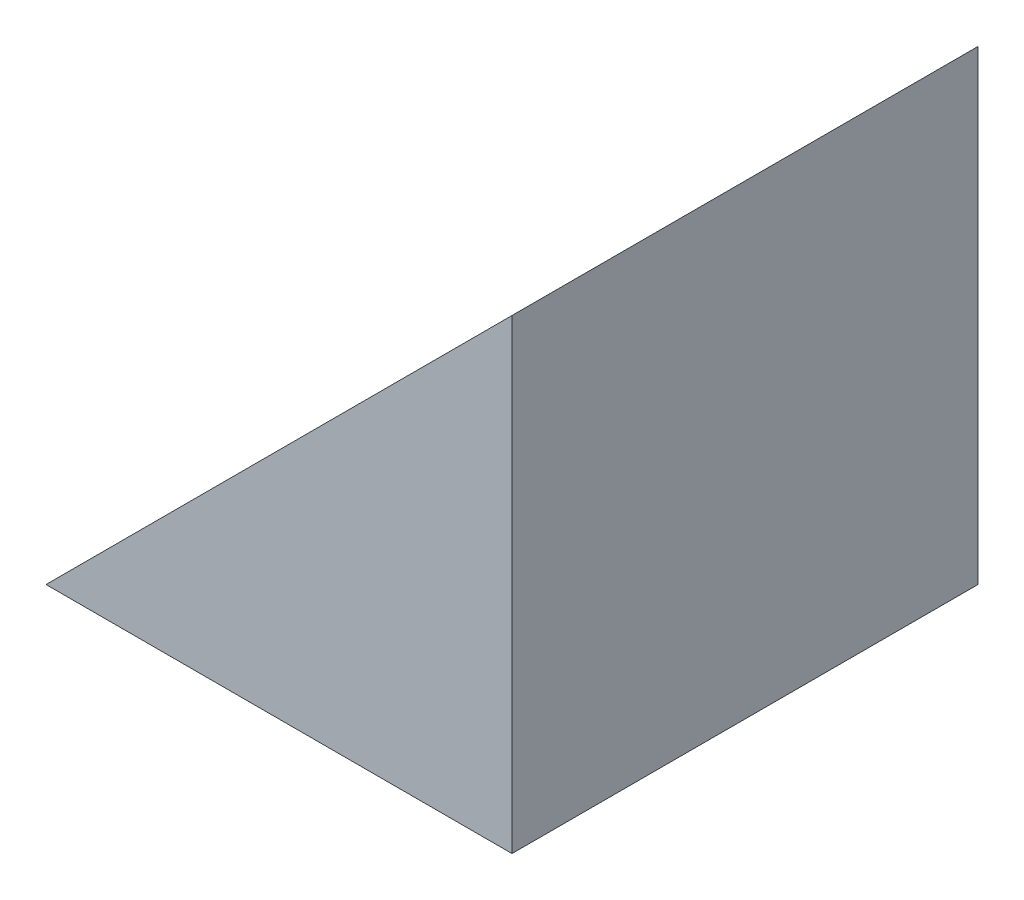
ISO-10303-21;
HEADER;
FILE_DESCRIPTION(('STEP AP214'),'2;1');
FILE_NAME('part.step','',(''),(''),'','','');
FILE_SCHEMA(('AUTOMOTIVE_DESIGN { 1 0 10303 214 1 1 1 1 }'));
ENDSEC;
DATA;
#1=APPLICATION_CONTEXT('core data for automotive mechanical design processes');
#2=APPLICATION_PROTOCOL_DEFINITION('international standard','automotive_design',2000,#1);
#3=PRODUCT_CONTEXT('',#1,'mechanical');
#4=PRODUCT('Part','Part','',(#3));
#5=PRODUCT_RELATED_PRODUCT_CATEGORY('part','',(#4));
#6=PRODUCT_DEFINITION_FORMATION('','',#4);
#7=PRODUCT_DEFINITION_CONTEXT('part definition',#1,'design');
#8=PRODUCT_DEFINITION('design','',#6,#7);
#9=PRODUCT_DEFINITION_SHAPE('','',#8);
#10=(LENGTH_UNIT() NAMED_UNIT(*) SI_UNIT(.MILLI.,.METRE.));
#11=(NAMED_UNIT(*) PLANE_ANGLE_UNIT() SI_UNIT($,.RADIAN.));
#12=(NAMED_UNIT(*) SI_UNIT($,.STERADIAN.) SOLID_ANGLE_UNIT());
#13=UNCERTAINTY_MEASURE_WITH_UNIT(LENGTH_MEASURE(1.E-05),#10,'distance_accuracy_value','');
#14=(GEOMETRIC_REPRESENTATION_CONTEXT(3) GLOBAL_UNCERTAINTY_ASSIGNED_CONTEXT((#13)) GLOBAL_UNIT_ASSIGNED_CONTEXT((#10,
#11,#12)) REPRESENTATION_CONTEXT('',''));
#15=CARTESIAN_POINT('',(0.,0.,0.));
#16=DIRECTION('',(0.,0.,1.));
#17=DIRECTION('',(1.,0.,0.));
#18=AXIS2_PLACEMENT_3D('',#15,#16,#17);
#19=CARTESIAN_POINT('',(-14.5945945945946,-17.5945945945946,30.));
#20=DIRECTION('',(0.,1.,0.));
#21=DIRECTION('',(0.,0.,1.));
#22=AXIS2_PLACEMENT_3D('',#19,#20,#21);
#23=PLANE('',#22);
#24=DIRECTION('',(1.,0.,0.));
#25=VECTOR('',#24,1.);
#26=CARTESIAN_POINT('',(-14.5945945945946,-17.5945945945946,0.));
#27=LINE('',#26,#25);
#28=CARTESIAN_POINT('',(-14.5945945945946,-17.5945945945946,0.));
#29=VERTEX_POINT('',#28);
#30=CARTESIAN_POINT('',(15.4054054054054,-17.5945945945946,0.));
#31=VERTEX_POINT('',#30);
#32=EDGE_CURVE('E80',#29,#31,#27,.T.);
#33=ORIENTED_EDGE('',*,*,#32,.T.);
#34=DIRECTION('',(0.,0.,-1.));
#35=VECTOR('',#34,1.);
#36=CARTESIAN_POINT('',(15.4054054054054,-17.5945945945946,30.));
#37=LINE('',#36,#35);
#38=CARTESIAN_POINT('',(15.4054054054054,-17.5945945945946,30.));
#39=VERTEX_POINT('',#38);
#40=EDGE_CURVE('E11',#39,#31,#37,.T.);
#41=ORIENTED_EDGE('',*,*,#40,.F.);
#42=DIRECTION('',(1.,0.,0.));
#43=VECTOR('',#42,1.);
#44=CARTESIAN_POINT('',(-14.5945945945946,-17.5945945945946,30.));
#45=LINE('',#44,#43);
#46=CARTESIAN_POINT('',(-14.5945945945946,-17.5945945945946,30.));
#47=VERTEX_POINT('',#46);
#48=EDGE_CURVE('E73',#47,#39,#45,.T.);
#49=ORIENTED_EDGE('',*,*,#48,.F.);
#50=DIRECTION('',(0.,0.,-1.));
#51=VECTOR('',#50,1.);
#52=CARTESIAN_POINT('',(-14.5945945945946,-17.5945945945946,30.));
#53=LINE('',#52,#51);
#54=EDGE_CURVE('E81',#47,#29,#53,.T.);
#55=ORIENTED_EDGE('',*,*,#54,.T.);
#56=EDGE_LOOP('',(#33,#41,#49,#55));
#57=FACE_BOUND('',#56,.T.);
#58=ADVANCED_FACE('F33',(#57),#23,.F.);
#59=CARTESIAN_POINT('',(15.4054054054054,-17.5945945945946,30.));
#60=DIRECTION('',(-1.,0.,0.));
#61=DIRECTION('',(0.,0.,1.));
#62=AXIS2_PLACEMENT_3D('',#59,#60,#61);
#63=PLANE('',#62);
#64=DIRECTION('',(0.,1.,0.));
#65=VECTOR('',#64,1.);
#66=CARTESIAN_POINT('',(15.4054054054054,-17.5945945945946,0.));
#67=LINE('',#66,#65);
#68=CARTESIAN_POINT('',(15.4054054054054,12.4054054054054,0.));
#69=VERTEX_POINT('',#68);
#70=EDGE_CURVE('E61',#31,#69,#67,.T.);
#71=ORIENTED_EDGE('',*,*,#70,.T.);
#72=DIRECTION('',(0.,0.,-1.));
#73=VECTOR('',#72,1.);
#74=CARTESIAN_POINT('',(15.4054054054054,12.4054054054054,30.));
#75=LINE('',#74,#73);
#76=CARTESIAN_POINT('',(15.4054054054054,12.4054054054054,30.));
#77=VERTEX_POINT('',#76);
#78=EDGE_CURVE('E41',#77,#69,#75,.T.);
#79=ORIENTED_EDGE('',*,*,#78,.F.);
#80=DIRECTION('',(0.,1.,0.));
#81=VECTOR('',#80,1.);
#82=CARTESIAN_POINT('',(15.4054054054054,-17.5945945945946,30.));
#83=LINE('',#82,#81);
#84=EDGE_CURVE('E69',#39,#77,#83,.T.);
#85=ORIENTED_EDGE('',*,*,#84,.F.);
#86=ORIENTED_EDGE('',*,*,#40,.T.);
#87=EDGE_LOOP('',(#71,#79,#85,#86));
#88=FACE_BOUND('',#87,.T.);
#89=ADVANCED_FACE('F70',(#88),#63,.F.);
#90=CARTESIAN_POINT('',(-14.5945945945946,-17.5945945945946,30.));
#91=DIRECTION('',(0.707106781186547,-0.707106781186547,0.));
#92=DIRECTION('',(0.707106781186548,0.707106781186548,0.));
#93=AXIS2_PLACEMENT_3D('',#90,#91,#92);
#94=PLANE('',#93);
#95=DIRECTION('',(-0.707106781186547,-0.707106781186547,0.));
#96=VECTOR('',#95,1.);
#97=CARTESIAN_POINT('',(-14.5945945945946,-17.5945945945946,0.));
#98=LINE('',#97,#96);
#99=EDGE_CURVE('E66',#69,#29,#98,.T.);
#100=ORIENTED_EDGE('',*,*,#99,.T.);
#101=ORIENTED_EDGE('',*,*,#54,.F.);
#102=DIRECTION('',(-0.707106781186547,-0.707106781186547,0.));
#103=VECTOR('',#102,1.);
#104=CARTESIAN_POINT('',(-14.5945945945946,-17.5945945945946,30.));
#105=LINE('',#104,#103);
#106=EDGE_CURVE('E49',#77,#47,#105,.T.);
#107=ORIENTED_EDGE('',*,*,#106,.F.);
#108=ORIENTED_EDGE('',*,*,#78,.T.);
#109=EDGE_LOOP('',(#100,#101,#107,#108));
#110=FACE_BOUND('',#109,.T.);
#111=ADVANCED_FACE('F88',(#110),#94,.F.);
#112=CARTESIAN_POINT('',(0.,0.,30.));
#113=DIRECTION('',(0.,0.,1.));
#114=DIRECTION('',(1.,0.,0.));
#115=AXIS2_PLACEMENT_3D('',#112,#113,#114);
#116=PLANE('',#115);
#117=ORIENTED_EDGE('',*,*,#48,.T.);
#118=ORIENTED_EDGE('',*,*,#84,.T.);
#119=ORIENTED_EDGE('',*,*,#106,.T.);
#120=EDGE_LOOP('',(#117,#118,#119));
#121=FACE_BOUND('',#120,.T.);
#122=ADVANCED_FACE('F76',(#121),#116,.T.);
#123=CARTESIAN_POINT('',(0.,0.,0.));
#124=DIRECTION('',(0.,0.,1.));
#125=DIRECTION('',(1.,0.,0.));
#126=AXIS2_PLACEMENT_3D('',#123,#124,#125);
#127=PLANE('',#126);
#128=ORIENTED_EDGE('',*,*,#32,.F.);
#129=ORIENTED_EDGE('',*,*,#99,.F.);
#130=ORIENTED_EDGE('',*,*,#70,.F.);
#131=EDGE_LOOP('',(#128,#129,#130));
#132=FACE_BOUND('',#131,.T.);
#133=ADVANCED_FACE('F89',(#132),#127,.F.);
#134=CLOSED_SHELL('',(#58,#89,#111,#122,#133));
#135=MANIFOLD_SOLID_BREP('B2',#134);
#136=ADVANCED_BREP_SHAPE_REPRESENTATION('',(#18,#135),#14);
#137=SHAPE_DEFINITION_REPRESENTATION(#9,#136);
ENDSEC;
END-ISO-10303-21;
